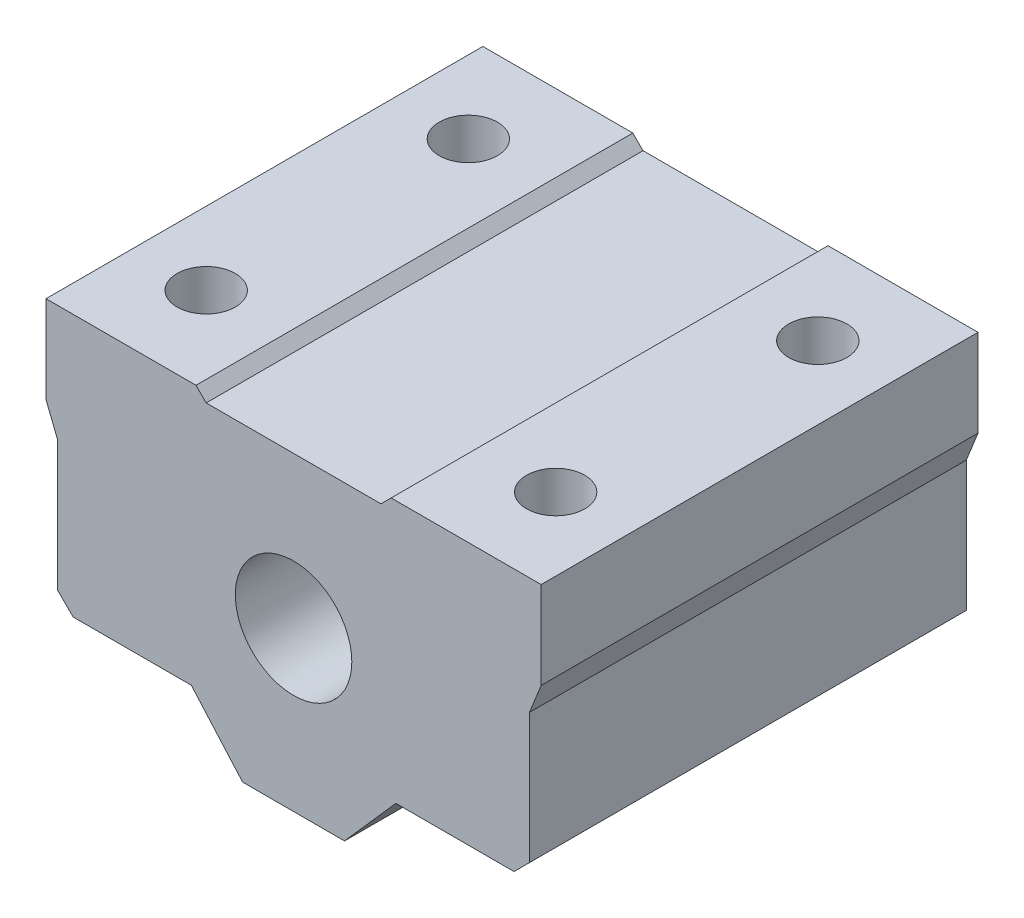
ISO-10303-21;
HEADER;
FILE_DESCRIPTION(('STEP AP214'),'2;1');
FILE_NAME('part.step','',(''),(''),'','','');
FILE_SCHEMA(('AUTOMOTIVE_DESIGN { 1 0 10303 214 1 1 1 1 }'));
ENDSEC;
DATA;
#1=APPLICATION_CONTEXT('core data for automotive mechanical design processes');
#2=APPLICATION_PROTOCOL_DEFINITION('international standard','automotive_design',2000,#1);
#3=PRODUCT_CONTEXT('',#1,'mechanical');
#4=PRODUCT('Part','Part','',(#3));
#5=PRODUCT_RELATED_PRODUCT_CATEGORY('part','',(#4));
#6=PRODUCT_DEFINITION_FORMATION('','',#4);
#7=PRODUCT_DEFINITION_CONTEXT('part definition',#1,'design');
#8=PRODUCT_DEFINITION('design','',#6,#7);
#9=PRODUCT_DEFINITION_SHAPE('','',#8);
#10=(LENGTH_UNIT() NAMED_UNIT(*) SI_UNIT(.MILLI.,.METRE.));
#11=(NAMED_UNIT(*) PLANE_ANGLE_UNIT() SI_UNIT($,.RADIAN.));
#12=(NAMED_UNIT(*) SI_UNIT($,.STERADIAN.) SOLID_ANGLE_UNIT());
#13=UNCERTAINTY_MEASURE_WITH_UNIT(LENGTH_MEASURE(1.E-05),#10,'distance_accuracy_value','');
#14=(GEOMETRIC_REPRESENTATION_CONTEXT(3) GLOBAL_UNCERTAINTY_ASSIGNED_CONTEXT((#13)) GLOBAL_UNIT_ASSIGNED_CONTEXT((#10,
#11,#12)) REPRESENTATION_CONTEXT('',''));
#15=CARTESIAN_POINT('',(0.,0.,0.));
#16=DIRECTION('',(0.,0.,1.));
#17=DIRECTION('',(1.,0.,0.));
#18=AXIS2_PLACEMENT_3D('',#15,#16,#17);
#19=CARTESIAN_POINT('',(0.,11.0960796301964,30.));
#20=DIRECTION('',(0.,1.,0.));
#21=DIRECTION('',(-1.,0.,0.));
#22=AXIS2_PLACEMENT_3D('',#19,#20,#21);
#23=PLANE('',#22);
#24=CARTESIAN_POINT('',(12.,11.0960796301964,24.));
#25=DIRECTION('',(0.,-1.,0.));
#26=DIRECTION('',(-1.,0.,0.));
#27=AXIS2_PLACEMENT_3D('',#24,#25,#26);
#28=CIRCLE('',#27,2.);
#29=CARTESIAN_POINT('',(10.,11.0960796301964,24.));
#30=VERTEX_POINT('',#29);
#31=EDGE_CURVE('E356',#30,#30,#28,.T.);
#32=ORIENTED_EDGE('',*,*,#31,.T.);
#33=EDGE_LOOP('',(#32));
#34=FACE_BOUND('',#33,.T.);
#35=CARTESIAN_POINT('',(12.,11.0960796301964,6.));
#36=DIRECTION('',(0.,-1.,0.));
#37=DIRECTION('',(-1.,0.,0.));
#38=AXIS2_PLACEMENT_3D('',#35,#36,#37);
#39=CIRCLE('',#38,2.);
#40=CARTESIAN_POINT('',(10.,11.0960796301964,6.));
#41=VERTEX_POINT('',#40);
#42=EDGE_CURVE('E359',#41,#41,#39,.T.);
#43=ORIENTED_EDGE('',*,*,#42,.T.);
#44=EDGE_LOOP('',(#43));
#45=FACE_BOUND('',#44,.T.);
#46=DIRECTION('',(1.,0.,0.));
#47=VECTOR('',#46,1.);
#48=CARTESIAN_POINT('',(0.,11.0960796301964,0.));
#49=LINE('',#48,#47);
#50=CARTESIAN_POINT('',(6.7,11.0960796301964,0.));
#51=VERTEX_POINT('',#50);
#52=CARTESIAN_POINT('',(17.,11.0960796301964,0.));
#53=VERTEX_POINT('',#52);
#54=EDGE_CURVE('E192',#51,#53,#49,.T.);
#55=ORIENTED_EDGE('',*,*,#54,.F.);
#56=DIRECTION('',(0.,0.,-1.));
#57=VECTOR('',#56,1.);
#58=CARTESIAN_POINT('',(6.7,11.0960796301964,30.));
#59=LINE('',#58,#57);
#60=CARTESIAN_POINT('',(6.7,11.0960796301964,30.));
#61=VERTEX_POINT('',#60);
#62=EDGE_CURVE('E11',#61,#51,#59,.T.);
#63=ORIENTED_EDGE('',*,*,#62,.F.);
#64=DIRECTION('',(1.,0.,0.));
#65=VECTOR('',#64,1.);
#66=CARTESIAN_POINT('',(0.,11.0960796301964,30.));
#67=LINE('',#66,#65);
#68=CARTESIAN_POINT('',(17.,11.0960796301964,30.));
#69=VERTEX_POINT('',#68);
#70=EDGE_CURVE('E240',#61,#69,#67,.T.);
#71=ORIENTED_EDGE('',*,*,#70,.T.);
#72=DIRECTION('',(0.,0.,-1.));
#73=VECTOR('',#72,1.);
#74=CARTESIAN_POINT('',(17.,11.0960796301964,30.));
#75=LINE('',#74,#73);
#76=EDGE_CURVE('E51',#69,#53,#75,.T.);
#77=ORIENTED_EDGE('',*,*,#76,.T.);
#78=EDGE_LOOP('',(#55,#63,#71,#77));
#79=FACE_BOUND('',#78,.T.);
#80=ADVANCED_FACE('F35',(#34,#45,#79),#23,.T.);
#81=CARTESIAN_POINT('',(-2.19803981509819,2.19803981509817,30.));
#82=DIRECTION('',(-0.70710678118655,0.707106781186545,0.));
#83=DIRECTION('',(-0.707106781186545,-0.70710678118655,0.));
#84=AXIS2_PLACEMENT_3D('',#81,#82,#83);
#85=PLANE('',#84);
#86=DIRECTION('',(0.707106781186545,0.70710678118655,0.));
#87=VECTOR('',#86,1.);
#88=CARTESIAN_POINT('',(-2.19803981509819,2.19803981509817,0.));
#89=LINE('',#88,#87);
#90=CARTESIAN_POINT('',(6.,10.3960796301964,0.));
#91=VERTEX_POINT('',#90);
#92=EDGE_CURVE('E194',#91,#51,#89,.T.);
#93=ORIENTED_EDGE('',*,*,#92,.F.);
#94=DIRECTION('',(0.,0.,-1.));
#95=VECTOR('',#94,1.);
#96=CARTESIAN_POINT('',(6.,10.3960796301964,30.));
#97=LINE('',#96,#95);
#98=CARTESIAN_POINT('',(6.,10.3960796301964,30.));
#99=VERTEX_POINT('',#98);
#100=EDGE_CURVE('E43',#99,#91,#97,.T.);
#101=ORIENTED_EDGE('',*,*,#100,.F.);
#102=DIRECTION('',(0.707106781186545,0.70710678118655,0.));
#103=VECTOR('',#102,1.);
#104=CARTESIAN_POINT('',(-2.19803981509819,2.19803981509817,30.));
#105=LINE('',#104,#103);
#106=EDGE_CURVE('E296',#99,#61,#105,.T.);
#107=ORIENTED_EDGE('',*,*,#106,.T.);
#108=ORIENTED_EDGE('',*,*,#62,.T.);
#109=EDGE_LOOP('',(#93,#101,#107,#108));
#110=FACE_BOUND('',#109,.T.);
#111=ADVANCED_FACE('F282',(#110),#85,.T.);
#112=CARTESIAN_POINT('',(0.,10.3960796301964,30.));
#113=DIRECTION('',(0.,1.,0.));
#114=DIRECTION('',(0.,0.,1.));
#115=AXIS2_PLACEMENT_3D('',#112,#113,#114);
#116=PLANE('',#115);
#117=DIRECTION('',(1.,0.,0.));
#118=VECTOR('',#117,1.);
#119=CARTESIAN_POINT('',(0.,10.3960796301964,0.));
#120=LINE('',#119,#118);
#121=CARTESIAN_POINT('',(-6.,10.3960796301964,0.));
#122=VERTEX_POINT('',#121);
#123=EDGE_CURVE('E198',#122,#91,#120,.T.);
#124=ORIENTED_EDGE('',*,*,#123,.F.);
#125=DIRECTION('',(0.,0.,-1.));
#126=VECTOR('',#125,1.);
#127=CARTESIAN_POINT('',(-6.,10.3960796301964,30.));
#128=LINE('',#127,#126);
#129=CARTESIAN_POINT('',(-6.,10.3960796301964,30.));
#130=VERTEX_POINT('',#129);
#131=EDGE_CURVE('E271',#130,#122,#128,.T.);
#132=ORIENTED_EDGE('',*,*,#131,.F.);
#133=DIRECTION('',(1.,0.,0.));
#134=VECTOR('',#133,1.);
#135=CARTESIAN_POINT('',(0.,10.3960796301964,30.));
#136=LINE('',#135,#134);
#137=EDGE_CURVE('E278',#130,#99,#136,.T.);
#138=ORIENTED_EDGE('',*,*,#137,.T.);
#139=ORIENTED_EDGE('',*,*,#100,.T.);
#140=EDGE_LOOP('',(#124,#132,#138,#139));
#141=FACE_BOUND('',#140,.T.);
#142=ADVANCED_FACE('F276',(#141),#116,.T.);
#143=CARTESIAN_POINT('',(2.1980398150982,2.19803981509819,30.));
#144=DIRECTION('',(0.707106781186549,0.707106781186546,0.));
#145=DIRECTION('',(-0.707106781186546,0.707106781186549,0.));
#146=AXIS2_PLACEMENT_3D('',#143,#144,#145);
#147=PLANE('',#146);
#148=DIRECTION('',(0.707106781186546,-0.707106781186549,0.));
#149=VECTOR('',#148,1.);
#150=CARTESIAN_POINT('',(2.1980398150982,2.19803981509819,0.));
#151=LINE('',#150,#149);
#152=CARTESIAN_POINT('',(-6.7,11.0960796301964,0.));
#153=VERTEX_POINT('',#152);
#154=EDGE_CURVE('E201',#153,#122,#151,.T.);
#155=ORIENTED_EDGE('',*,*,#154,.F.);
#156=DIRECTION('',(0.,0.,-1.));
#157=VECTOR('',#156,1.);
#158=CARTESIAN_POINT('',(-6.7,11.0960796301964,30.));
#159=LINE('',#158,#157);
#160=CARTESIAN_POINT('',(-6.7,11.0960796301964,30.));
#161=VERTEX_POINT('',#160);
#162=EDGE_CURVE('E269',#161,#153,#159,.T.);
#163=ORIENTED_EDGE('',*,*,#162,.F.);
#164=DIRECTION('',(0.707106781186546,-0.707106781186549,0.));
#165=VECTOR('',#164,1.);
#166=CARTESIAN_POINT('',(2.1980398150982,2.19803981509819,30.));
#167=LINE('',#166,#165);
#168=EDGE_CURVE('E293',#161,#130,#167,.T.);
#169=ORIENTED_EDGE('',*,*,#168,.T.);
#170=ORIENTED_EDGE('',*,*,#131,.T.);
#171=EDGE_LOOP('',(#155,#163,#169,#170));
#172=FACE_BOUND('',#171,.T.);
#173=ADVANCED_FACE('F290',(#172),#147,.T.);
#174=CARTESIAN_POINT('',(0.,11.0960796301964,30.));
#175=DIRECTION('',(0.,1.,0.));
#176=DIRECTION('',(0.,0.,1.));
#177=AXIS2_PLACEMENT_3D('',#174,#175,#176);
#178=PLANE('',#177);
#179=CARTESIAN_POINT('',(-12.,11.0960796301964,6.));
#180=DIRECTION('',(0.,-1.,0.));
#181=DIRECTION('',(1.,0.,0.));
#182=AXIS2_PLACEMENT_3D('',#179,#180,#181);
#183=CIRCLE('',#182,2.);
#184=CARTESIAN_POINT('',(-10.,11.0960796301964,6.));
#185=VERTEX_POINT('',#184);
#186=EDGE_CURVE('E365',#185,#185,#183,.T.);
#187=ORIENTED_EDGE('',*,*,#186,.T.);
#188=EDGE_LOOP('',(#187));
#189=FACE_BOUND('',#188,.T.);
#190=CARTESIAN_POINT('',(-12.,11.0960796301964,24.));
#191=DIRECTION('',(0.,-1.,0.));
#192=DIRECTION('',(1.,0.,0.));
#193=AXIS2_PLACEMENT_3D('',#190,#191,#192);
#194=CIRCLE('',#193,2.);
#195=CARTESIAN_POINT('',(-10.,11.0960796301964,24.));
#196=VERTEX_POINT('',#195);
#197=EDGE_CURVE('E195',#196,#196,#194,.T.);
#198=ORIENTED_EDGE('',*,*,#197,.T.);
#199=EDGE_LOOP('',(#198));
#200=FACE_BOUND('',#199,.T.);
#201=DIRECTION('',(1.,0.,0.));
#202=VECTOR('',#201,1.);
#203=CARTESIAN_POINT('',(0.,11.0960796301964,0.));
#204=LINE('',#203,#202);
#205=CARTESIAN_POINT('',(-17.,11.0960796301964,0.));
#206=VERTEX_POINT('',#205);
#207=EDGE_CURVE('E204',#206,#153,#204,.T.);
#208=ORIENTED_EDGE('',*,*,#207,.F.);
#209=DIRECTION('',(0.,0.,-1.));
#210=VECTOR('',#209,1.);
#211=CARTESIAN_POINT('',(-17.,11.0960796301964,30.));
#212=LINE('',#211,#210);
#213=CARTESIAN_POINT('',(-17.,11.0960796301964,30.));
#214=VERTEX_POINT('',#213);
#215=EDGE_CURVE('E267',#214,#206,#212,.T.);
#216=ORIENTED_EDGE('',*,*,#215,.F.);
#217=DIRECTION('',(1.,0.,0.));
#218=VECTOR('',#217,1.);
#219=CARTESIAN_POINT('',(0.,11.0960796301964,30.));
#220=LINE('',#219,#218);
#221=EDGE_CURVE('E298',#214,#161,#220,.T.);
#222=ORIENTED_EDGE('',*,*,#221,.T.);
#223=ORIENTED_EDGE('',*,*,#162,.T.);
#224=EDGE_LOOP('',(#208,#216,#222,#223));
#225=FACE_BOUND('',#224,.T.);
#226=ADVANCED_FACE('F431',(#189,#200,#225),#178,.T.);
#227=CARTESIAN_POINT('',(-17.,0.,30.));
#228=DIRECTION('',(1.,0.,0.));
#229=DIRECTION('',(0.,0.,-1.));
#230=AXIS2_PLACEMENT_3D('',#227,#228,#229);
#231=PLANE('',#230);
#232=DIRECTION('',(0.,-1.,0.));
#233=VECTOR('',#232,1.);
#234=CARTESIAN_POINT('',(-17.,0.,0.));
#235=LINE('',#234,#233);
#236=CARTESIAN_POINT('',(-17.,5.09607963019642,0.));
#237=VERTEX_POINT('',#236);
#238=EDGE_CURVE('E207',#206,#237,#235,.T.);
#239=ORIENTED_EDGE('',*,*,#238,.T.);
#240=DIRECTION('',(0.,0.,-1.));
#241=VECTOR('',#240,1.);
#242=CARTESIAN_POINT('',(-17.,5.09607963019642,30.));
#243=LINE('',#242,#241);
#244=CARTESIAN_POINT('',(-17.,5.09607963019642,30.));
#245=VERTEX_POINT('',#244);
#246=EDGE_CURVE('E264',#245,#237,#243,.T.);
#247=ORIENTED_EDGE('',*,*,#246,.F.);
#248=DIRECTION('',(0.,-1.,0.));
#249=VECTOR('',#248,1.);
#250=CARTESIAN_POINT('',(-17.,0.,30.));
#251=LINE('',#250,#249);
#252=EDGE_CURVE('E304',#214,#245,#251,.T.);
#253=ORIENTED_EDGE('',*,*,#252,.F.);
#254=ORIENTED_EDGE('',*,*,#215,.T.);
#255=EDGE_LOOP('',(#239,#247,#253,#254));
#256=FACE_BOUND('',#255,.T.);
#257=ADVANCED_FACE('F427',(#256),#231,.F.);
#258=CARTESIAN_POINT('',(-12.8979035757943,-5.15916143031773,30.));
#259=DIRECTION('',(0.92847669088526,0.371390676354103,0.));
#260=DIRECTION('',(-0.371390676354103,0.92847669088526,0.));
#261=AXIS2_PLACEMENT_3D('',#258,#259,#260);
#262=PLANE('',#261);
#263=DIRECTION('',(0.371390676354103,-0.92847669088526,0.));
#264=VECTOR('',#263,1.);
#265=CARTESIAN_POINT('',(-12.8979035757943,-5.15916143031773,0.));
#266=LINE('',#265,#264);
#267=CARTESIAN_POINT('',(-16.2,3.09607963019642,0.));
#268=VERTEX_POINT('',#267);
#269=EDGE_CURVE('E209',#237,#268,#266,.T.);
#270=ORIENTED_EDGE('',*,*,#269,.T.);
#271=DIRECTION('',(0.,0.,-1.));
#272=VECTOR('',#271,1.);
#273=CARTESIAN_POINT('',(-16.2,3.09607963019642,30.));
#274=LINE('',#273,#272);
#275=CARTESIAN_POINT('',(-16.2,3.09607963019642,30.));
#276=VERTEX_POINT('',#275);
#277=EDGE_CURVE('E261',#276,#268,#274,.T.);
#278=ORIENTED_EDGE('',*,*,#277,.F.);
#279=DIRECTION('',(0.371390676354103,-0.92847669088526,0.));
#280=VECTOR('',#279,1.);
#281=CARTESIAN_POINT('',(-12.8979035757943,-5.15916143031773,30.));
#282=LINE('',#281,#280);
#283=EDGE_CURVE('E306',#245,#276,#282,.T.);
#284=ORIENTED_EDGE('',*,*,#283,.F.);
#285=ORIENTED_EDGE('',*,*,#246,.T.);
#286=EDGE_LOOP('',(#270,#278,#284,#285));
#287=FACE_BOUND('',#286,.T.);
#288=ADVANCED_FACE('F423',(#287),#262,.F.);
#289=CARTESIAN_POINT('',(-16.2,0.,30.));
#290=DIRECTION('',(1.,0.,0.));
#291=DIRECTION('',(0.,0.,-1.));
#292=AXIS2_PLACEMENT_3D('',#289,#290,#291);
#293=PLANE('',#292);
#294=DIRECTION('',(0.,-1.,0.));
#295=VECTOR('',#294,1.);
#296=CARTESIAN_POINT('',(-16.2,0.,0.));
#297=LINE('',#296,#295);
#298=CARTESIAN_POINT('',(-16.2,-5.84326019802376,0.));
#299=VERTEX_POINT('',#298);
#300=EDGE_CURVE('E211',#268,#299,#297,.T.);
#301=ORIENTED_EDGE('',*,*,#300,.T.);
#302=DIRECTION('',(0.,0.,-1.));
#303=VECTOR('',#302,1.);
#304=CARTESIAN_POINT('',(-16.2,-5.84326019802376,30.));
#305=LINE('',#304,#303);
#306=CARTESIAN_POINT('',(-16.2,-5.84326019802376,30.));
#307=VERTEX_POINT('',#306);
#308=EDGE_CURVE('E258',#307,#299,#305,.T.);
#309=ORIENTED_EDGE('',*,*,#308,.F.);
#310=DIRECTION('',(0.,-1.,0.));
#311=VECTOR('',#310,1.);
#312=CARTESIAN_POINT('',(-16.2,0.,30.));
#313=LINE('',#312,#311);
#314=EDGE_CURVE('E308',#276,#307,#313,.T.);
#315=ORIENTED_EDGE('',*,*,#314,.F.);
#316=ORIENTED_EDGE('',*,*,#277,.T.);
#317=EDGE_LOOP('',(#301,#309,#315,#316));
#318=FACE_BOUND('',#317,.T.);
#319=ADVANCED_FACE('F419',(#318),#293,.F.);
#320=CARTESIAN_POINT('',(-11.0216300990119,-11.0216300990119,30.));
#321=DIRECTION('',(0.707106781186548,0.707106781186547,0.));
#322=DIRECTION('',(-0.707106781186547,0.707106781186548,0.));
#323=AXIS2_PLACEMENT_3D('',#320,#321,#322);
#324=PLANE('',#323);
#325=DIRECTION('',(0.707106781186547,-0.707106781186548,0.));
#326=VECTOR('',#325,1.);
#327=CARTESIAN_POINT('',(-11.0216300990119,-11.0216300990119,0.));
#328=LINE('',#327,#326);
#329=CARTESIAN_POINT('',(-15.1393398282202,-6.90392036980358,0.));
#330=VERTEX_POINT('',#329);
#331=EDGE_CURVE('E213',#299,#330,#328,.T.);
#332=ORIENTED_EDGE('',*,*,#331,.T.);
#333=DIRECTION('',(0.,0.,-1.));
#334=VECTOR('',#333,1.);
#335=CARTESIAN_POINT('',(-15.1393398282202,-6.90392036980358,30.));
#336=LINE('',#335,#334);
#337=CARTESIAN_POINT('',(-15.1393398282202,-6.90392036980358,30.));
#338=VERTEX_POINT('',#337);
#339=EDGE_CURVE('E256',#338,#330,#336,.T.);
#340=ORIENTED_EDGE('',*,*,#339,.F.);
#341=DIRECTION('',(0.707106781186547,-0.707106781186548,0.));
#342=VECTOR('',#341,1.);
#343=CARTESIAN_POINT('',(-11.0216300990119,-11.0216300990119,30.));
#344=LINE('',#343,#342);
#345=EDGE_CURVE('E310',#307,#338,#344,.T.);
#346=ORIENTED_EDGE('',*,*,#345,.F.);
#347=ORIENTED_EDGE('',*,*,#308,.T.);
#348=EDGE_LOOP('',(#332,#340,#346,#347));
#349=FACE_BOUND('',#348,.T.);
#350=ADVANCED_FACE('F387',(#349),#324,.F.);
#351=CARTESIAN_POINT('',(0.,-6.90392036980358,30.));
#352=DIRECTION('',(0.,-1.,0.));
#353=DIRECTION('',(1.,0.,0.));
#354=AXIS2_PLACEMENT_3D('',#351,#352,#353);
#355=PLANE('',#354);
#356=CARTESIAN_POINT('',(-12.,-6.90392036980358,6.));
#357=DIRECTION('',(0.,-1.,0.));
#358=DIRECTION('',(1.,0.,0.));
#359=AXIS2_PLACEMENT_3D('',#356,#357,#358);
#360=CIRCLE('',#359,2.);
#361=CARTESIAN_POINT('',(-10.,-6.90392036980358,6.));
#362=VERTEX_POINT('',#361);
#363=EDGE_CURVE('E361',#362,#362,#360,.T.);
#364=ORIENTED_EDGE('',*,*,#363,.F.);
#365=EDGE_LOOP('',(#364));
#366=FACE_BOUND('',#365,.T.);
#367=CARTESIAN_POINT('',(-12.,-6.90392036980358,24.));
#368=DIRECTION('',(0.,-1.,0.));
#369=DIRECTION('',(1.,0.,0.));
#370=AXIS2_PLACEMENT_3D('',#367,#368,#369);
#371=CIRCLE('',#370,2.);
#372=CARTESIAN_POINT('',(-10.,-6.90392036980358,24.));
#373=VERTEX_POINT('',#372);
#374=EDGE_CURVE('E374',#373,#373,#371,.T.);
#375=ORIENTED_EDGE('',*,*,#374,.F.);
#376=EDGE_LOOP('',(#375));
#377=FACE_BOUND('',#376,.T.);
#378=DIRECTION('',(-1.,0.,0.));
#379=VECTOR('',#378,1.);
#380=CARTESIAN_POINT('',(0.,-6.90392036980358,0.));
#381=LINE('',#380,#379);
#382=CARTESIAN_POINT('',(-7.0246075966208,-6.90392036980358,0.));
#383=VERTEX_POINT('',#382);
#384=EDGE_CURVE('E216',#383,#330,#381,.T.);
#385=ORIENTED_EDGE('',*,*,#384,.F.);
#386=DIRECTION('',(0.,0.,-1.));
#387=VECTOR('',#386,1.);
#388=CARTESIAN_POINT('',(-7.0246075966208,-6.90392036980358,30.));
#389=LINE('',#388,#387);
#390=CARTESIAN_POINT('',(-7.0246075966208,-6.90392036980358,30.));
#391=VERTEX_POINT('',#390);
#392=EDGE_CURVE('E254',#391,#383,#389,.T.);
#393=ORIENTED_EDGE('',*,*,#392,.F.);
#394=DIRECTION('',(-1.,0.,0.));
#395=VECTOR('',#394,1.);
#396=CARTESIAN_POINT('',(0.,-6.90392036980358,30.));
#397=LINE('',#396,#395);
#398=EDGE_CURVE('E312',#391,#338,#397,.T.);
#399=ORIENTED_EDGE('',*,*,#398,.T.);
#400=ORIENTED_EDGE('',*,*,#339,.T.);
#401=EDGE_LOOP('',(#385,#393,#399,#400));
#402=FACE_BOUND('',#401,.T.);
#403=ADVANCED_FACE('F383',(#366,#377,#402),#355,.T.);
#404=CARTESIAN_POINT('',(-7.37885532247622,-6.50189238099138,30.));
#405=DIRECTION('',(-0.750284739622902,-0.661114823225885,0.));
#406=DIRECTION('',(0.661114823225885,-0.750284739622902,0.));
#407=AXIS2_PLACEMENT_3D('',#404,#405,#406);
#408=PLANE('',#407);
#409=DIRECTION('',(-0.661114823225885,0.750284739622902,0.));
#410=VECTOR('',#409,1.);
#411=CARTESIAN_POINT('',(-7.37885532247622,-6.50189238099138,0.));
#412=LINE('',#411,#410);
#413=CARTESIAN_POINT('',(-3.5,-10.9039203698036,0.));
#414=VERTEX_POINT('',#413);
#415=EDGE_CURVE('E219',#414,#383,#412,.T.);
#416=ORIENTED_EDGE('',*,*,#415,.F.);
#417=DIRECTION('',(0.,0.,-1.));
#418=VECTOR('',#417,1.);
#419=CARTESIAN_POINT('',(-3.5,-10.9039203698036,30.));
#420=LINE('',#419,#418);
#421=CARTESIAN_POINT('',(-3.5,-10.9039203698036,30.));
#422=VERTEX_POINT('',#421);
#423=EDGE_CURVE('E252',#422,#414,#420,.T.);
#424=ORIENTED_EDGE('',*,*,#423,.F.);
#425=DIRECTION('',(-0.661114823225885,0.750284739622902,0.));
#426=VECTOR('',#425,1.);
#427=CARTESIAN_POINT('',(-7.37885532247622,-6.50189238099138,30.));
#428=LINE('',#427,#426);
#429=EDGE_CURVE('E315',#422,#391,#428,.T.);
#430=ORIENTED_EDGE('',*,*,#429,.T.);
#431=ORIENTED_EDGE('',*,*,#392,.T.);
#432=EDGE_LOOP('',(#416,#424,#430,#431));
#433=FACE_BOUND('',#432,.T.);
#434=ADVANCED_FACE('F386',(#433),#408,.T.);
#435=CARTESIAN_POINT('',(0.,-10.9039203698036,30.));
#436=DIRECTION('',(0.,-1.,0.));
#437=DIRECTION('',(1.,0.,0.));
#438=AXIS2_PLACEMENT_3D('',#435,#436,#437);
#439=PLANE('',#438);
#440=DIRECTION('',(-1.,0.,0.));
#441=VECTOR('',#440,1.);
#442=CARTESIAN_POINT('',(0.,-10.9039203698036,0.));
#443=LINE('',#442,#441);
#444=CARTESIAN_POINT('',(3.5,-10.9039203698036,0.));
#445=VERTEX_POINT('',#444);
#446=EDGE_CURVE('E222',#445,#414,#443,.T.);
#447=ORIENTED_EDGE('',*,*,#446,.F.);
#448=DIRECTION('',(0.,0.,-1.));
#449=VECTOR('',#448,1.);
#450=CARTESIAN_POINT('',(3.5,-10.9039203698036,30.));
#451=LINE('',#450,#449);
#452=CARTESIAN_POINT('',(3.5,-10.9039203698036,30.));
#453=VERTEX_POINT('',#452);
#454=EDGE_CURVE('E250',#453,#445,#451,.T.);
#455=ORIENTED_EDGE('',*,*,#454,.F.);
#456=DIRECTION('',(-1.,0.,0.));
#457=VECTOR('',#456,1.);
#458=CARTESIAN_POINT('',(0.,-10.9039203698036,30.));
#459=LINE('',#458,#457);
#460=EDGE_CURVE('E318',#453,#422,#459,.T.);
#461=ORIENTED_EDGE('',*,*,#460,.T.);
#462=ORIENTED_EDGE('',*,*,#423,.T.);
#463=EDGE_LOOP('',(#447,#455,#461,#462));
#464=FACE_BOUND('',#463,.T.);
#465=ADVANCED_FACE('F400',(#464),#439,.T.);
#466=CARTESIAN_POINT('',(7.37885532247623,-6.50189238099133,30.));
#467=DIRECTION('',(-0.750284739622905,0.661114823225882,0.));
#468=DIRECTION('',(-0.661114823225882,-0.750284739622905,0.));
#469=AXIS2_PLACEMENT_3D('',#466,#467,#468);
#470=PLANE('',#469);
#471=DIRECTION('',(0.661114823225882,0.750284739622905,0.));
#472=VECTOR('',#471,1.);
#473=CARTESIAN_POINT('',(7.37885532247623,-6.50189238099133,0.));
#474=LINE('',#473,#472);
#475=CARTESIAN_POINT('',(7.02460759662078,-6.90392036980357,0.));
#476=VERTEX_POINT('',#475);
#477=EDGE_CURVE('E225',#445,#476,#474,.T.);
#478=ORIENTED_EDGE('',*,*,#477,.T.);
#479=DIRECTION('',(0.,0.,-1.));
#480=VECTOR('',#479,1.);
#481=CARTESIAN_POINT('',(7.02460759662078,-6.90392036980357,30.));
#482=LINE('',#481,#480);
#483=CARTESIAN_POINT('',(7.02460759662078,-6.90392036980357,30.));
#484=VERTEX_POINT('',#483);
#485=EDGE_CURVE('E247',#484,#476,#482,.T.);
#486=ORIENTED_EDGE('',*,*,#485,.F.);
#487=DIRECTION('',(0.661114823225882,0.750284739622905,0.));
#488=VECTOR('',#487,1.);
#489=CARTESIAN_POINT('',(7.37885532247623,-6.50189238099133,30.));
#490=LINE('',#489,#488);
#491=EDGE_CURVE('E321',#453,#484,#490,.T.);
#492=ORIENTED_EDGE('',*,*,#491,.F.);
#493=ORIENTED_EDGE('',*,*,#454,.T.);
#494=EDGE_LOOP('',(#478,#486,#492,#493));
#495=FACE_BOUND('',#494,.T.);
#496=ADVANCED_FACE('F402',(#495),#470,.F.);
#497=CARTESIAN_POINT('',(0.,-6.90392036980356,30.));
#498=DIRECTION('',(0.,1.,0.));
#499=DIRECTION('',(-1.,0.,0.));
#500=AXIS2_PLACEMENT_3D('',#497,#498,#499);
#501=PLANE('',#500);
#502=CARTESIAN_POINT('',(12.,-6.90392036980357,24.));
#503=DIRECTION('',(0.,-1.,0.));
#504=DIRECTION('',(-1.,0.,0.));
#505=AXIS2_PLACEMENT_3D('',#502,#503,#504);
#506=CIRCLE('',#505,2.);
#507=CARTESIAN_POINT('',(10.,-6.90392036980357,24.));
#508=VERTEX_POINT('',#507);
#509=EDGE_CURVE('E370',#508,#508,#506,.T.);
#510=ORIENTED_EDGE('',*,*,#509,.F.);
#511=EDGE_LOOP('',(#510));
#512=FACE_BOUND('',#511,.T.);
#513=CARTESIAN_POINT('',(12.,-6.90392036980357,6.));
#514=DIRECTION('',(0.,-1.,0.));
#515=DIRECTION('',(-1.,0.,0.));
#516=AXIS2_PLACEMENT_3D('',#513,#514,#515);
#517=CIRCLE('',#516,2.);
#518=CARTESIAN_POINT('',(10.,-6.90392036980357,6.));
#519=VERTEX_POINT('',#518);
#520=EDGE_CURVE('E362',#519,#519,#517,.T.);
#521=ORIENTED_EDGE('',*,*,#520,.F.);
#522=EDGE_LOOP('',(#521));
#523=FACE_BOUND('',#522,.T.);
#524=DIRECTION('',(1.,0.,0.));
#525=VECTOR('',#524,1.);
#526=CARTESIAN_POINT('',(0.,-6.90392036980356,0.));
#527=LINE('',#526,#525);
#528=CARTESIAN_POINT('',(15.1393398282202,-6.90392036980357,0.));
#529=VERTEX_POINT('',#528);
#530=EDGE_CURVE('E227',#476,#529,#527,.T.);
#531=ORIENTED_EDGE('',*,*,#530,.T.);
#532=DIRECTION('',(0.,0.,-1.));
#533=VECTOR('',#532,1.);
#534=CARTESIAN_POINT('',(15.1393398282202,-6.90392036980357,30.));
#535=LINE('',#534,#533);
#536=CARTESIAN_POINT('',(15.1393398282202,-6.90392036980357,30.));
#537=VERTEX_POINT('',#536);
#538=EDGE_CURVE('E244',#537,#529,#535,.T.);
#539=ORIENTED_EDGE('',*,*,#538,.F.);
#540=DIRECTION('',(1.,0.,0.));
#541=VECTOR('',#540,1.);
#542=CARTESIAN_POINT('',(0.,-6.90392036980356,30.));
#543=LINE('',#542,#541);
#544=EDGE_CURVE('E323',#484,#537,#543,.T.);
#545=ORIENTED_EDGE('',*,*,#544,.F.);
#546=ORIENTED_EDGE('',*,*,#485,.T.);
#547=EDGE_LOOP('',(#531,#539,#545,#546));
#548=FACE_BOUND('',#547,.T.);
#549=ADVANCED_FACE('F330',(#512,#523,#548),#501,.F.);
#550=CARTESIAN_POINT('',(11.0216300990119,-11.0216300990119,30.));
#551=DIRECTION('',(-0.707106781186547,0.707106781186548,0.));
#552=DIRECTION('',(-0.707106781186548,-0.707106781186547,0.));
#553=AXIS2_PLACEMENT_3D('',#550,#551,#552);
#554=PLANE('',#553);
#555=DIRECTION('',(0.707106781186548,0.707106781186547,0.));
#556=VECTOR('',#555,1.);
#557=CARTESIAN_POINT('',(11.0216300990119,-11.0216300990119,0.));
#558=LINE('',#557,#556);
#559=CARTESIAN_POINT('',(16.2,-5.84326019802375,0.));
#560=VERTEX_POINT('',#559);
#561=EDGE_CURVE('E229',#529,#560,#558,.T.);
#562=ORIENTED_EDGE('',*,*,#561,.T.);
#563=DIRECTION('',(0.,0.,-1.));
#564=VECTOR('',#563,1.);
#565=CARTESIAN_POINT('',(16.2,-5.84326019802375,30.));
#566=LINE('',#565,#564);
#567=CARTESIAN_POINT('',(16.2,-5.84326019802375,30.));
#568=VERTEX_POINT('',#567);
#569=EDGE_CURVE('E181',#568,#560,#566,.T.);
#570=ORIENTED_EDGE('',*,*,#569,.F.);
#571=DIRECTION('',(0.707106781186548,0.707106781186547,0.));
#572=VECTOR('',#571,1.);
#573=CARTESIAN_POINT('',(11.0216300990119,-11.0216300990119,30.));
#574=LINE('',#573,#572);
#575=EDGE_CURVE('E169',#537,#568,#574,.T.);
#576=ORIENTED_EDGE('',*,*,#575,.F.);
#577=ORIENTED_EDGE('',*,*,#538,.T.);
#578=EDGE_LOOP('',(#562,#570,#576,#577));
#579=FACE_BOUND('',#578,.T.);
#580=ADVANCED_FACE('F334',(#579),#554,.F.);
#581=CARTESIAN_POINT('',(16.2,0.,30.));
#582=DIRECTION('',(-1.,0.,0.));
#583=DIRECTION('',(0.,-1.,0.));
#584=AXIS2_PLACEMENT_3D('',#581,#582,#583);
#585=PLANE('',#584);
#586=DIRECTION('',(0.,1.,0.));
#587=VECTOR('',#586,1.);
#588=CARTESIAN_POINT('',(16.2,0.,0.));
#589=LINE('',#588,#587);
#590=CARTESIAN_POINT('',(16.2,3.09607963019643,0.));
#591=VERTEX_POINT('',#590);
#592=EDGE_CURVE('E178',#560,#591,#589,.T.);
#593=ORIENTED_EDGE('',*,*,#592,.T.);
#594=DIRECTION('',(0.,0.,-1.));
#595=VECTOR('',#594,1.);
#596=CARTESIAN_POINT('',(16.2,3.09607963019643,30.));
#597=LINE('',#596,#595);
#598=CARTESIAN_POINT('',(16.2,3.09607963019643,30.));
#599=VERTEX_POINT('',#598);
#600=EDGE_CURVE('E175',#599,#591,#597,.T.);
#601=ORIENTED_EDGE('',*,*,#600,.F.);
#602=DIRECTION('',(0.,1.,0.));
#603=VECTOR('',#602,1.);
#604=CARTESIAN_POINT('',(16.2,0.,30.));
#605=LINE('',#604,#603);
#606=EDGE_CURVE('E161',#568,#599,#605,.T.);
#607=ORIENTED_EDGE('',*,*,#606,.F.);
#608=ORIENTED_EDGE('',*,*,#569,.T.);
#609=EDGE_LOOP('',(#593,#601,#607,#608));
#610=FACE_BOUND('',#609,.T.);
#611=ADVANCED_FACE('F176',(#610),#585,.F.);
#612=CARTESIAN_POINT('',(12.8979035757942,-5.15916143031781,30.));
#613=DIRECTION('',(0.928476690885256,-0.371390676354111,0.));
#614=DIRECTION('',(0.371390676354111,0.928476690885256,0.));
#615=AXIS2_PLACEMENT_3D('',#612,#613,#614);
#616=PLANE('',#615);
#617=DIRECTION('',(-0.371390676354111,-0.928476690885256,0.));
#618=VECTOR('',#617,1.);
#619=CARTESIAN_POINT('',(12.8979035757942,-5.15916143031781,0.));
#620=LINE('',#619,#618);
#621=CARTESIAN_POINT('',(17.,5.09607963019642,0.));
#622=VERTEX_POINT('',#621);
#623=EDGE_CURVE('E232',#622,#591,#620,.T.);
#624=ORIENTED_EDGE('',*,*,#623,.F.);
#625=DIRECTION('',(0.,0.,-1.));
#626=VECTOR('',#625,1.);
#627=CARTESIAN_POINT('',(17.,5.09607963019642,30.));
#628=LINE('',#627,#626);
#629=CARTESIAN_POINT('',(17.,5.09607963019642,30.));
#630=VERTEX_POINT('',#629);
#631=EDGE_CURVE('E106',#630,#622,#628,.T.);
#632=ORIENTED_EDGE('',*,*,#631,.F.);
#633=DIRECTION('',(-0.371390676354111,-0.928476690885256,0.));
#634=VECTOR('',#633,1.);
#635=CARTESIAN_POINT('',(12.8979035757942,-5.15916143031781,30.));
#636=LINE('',#635,#634);
#637=EDGE_CURVE('E167',#630,#599,#636,.T.);
#638=ORIENTED_EDGE('',*,*,#637,.T.);
#639=ORIENTED_EDGE('',*,*,#600,.T.);
#640=EDGE_LOOP('',(#624,#632,#638,#639));
#641=FACE_BOUND('',#640,.T.);
#642=ADVANCED_FACE('F183',(#641),#616,.T.);
#643=CARTESIAN_POINT('',(17.,0.,30.));
#644=DIRECTION('',(1.,0.,0.));
#645=DIRECTION('',(0.,0.,-1.));
#646=AXIS2_PLACEMENT_3D('',#643,#644,#645);
#647=PLANE('',#646);
#648=DIRECTION('',(0.,-1.,0.));
#649=VECTOR('',#648,1.);
#650=CARTESIAN_POINT('',(17.,0.,0.));
#651=LINE('',#650,#649);
#652=EDGE_CURVE('E234',#53,#622,#651,.T.);
#653=ORIENTED_EDGE('',*,*,#652,.F.);
#654=ORIENTED_EDGE('',*,*,#76,.F.);
#655=DIRECTION('',(0.,-1.,0.));
#656=VECTOR('',#655,1.);
#657=CARTESIAN_POINT('',(17.,0.,30.));
#658=LINE('',#657,#656);
#659=EDGE_CURVE('E184',#69,#630,#658,.T.);
#660=ORIENTED_EDGE('',*,*,#659,.T.);
#661=ORIENTED_EDGE('',*,*,#631,.T.);
#662=EDGE_LOOP('',(#653,#654,#660,#661));
#663=FACE_BOUND('',#662,.T.);
#664=ADVANCED_FACE('F335',(#663),#647,.T.);
#665=CARTESIAN_POINT('',(0.,0.,30.));
#666=DIRECTION('',(0.,0.,-1.));
#667=DIRECTION('',(-1.,0.,0.));
#668=AXIS2_PLACEMENT_3D('',#665,#666,#667);
#669=CYLINDRICAL_SURFACE('',#668,4.);
#670=CARTESIAN_POINT('',(0.,0.,30.));
#671=DIRECTION('',(0.,0.,1.));
#672=DIRECTION('',(1.,0.,0.));
#673=AXIS2_PLACEMENT_3D('',#670,#671,#672);
#674=CIRCLE('',#673,4.);
#675=CARTESIAN_POINT('',(4.,0.,30.));
#676=VERTEX_POINT('',#675);
#677=EDGE_CURVE('E186',#676,#676,#674,.T.);
#678=ORIENTED_EDGE('',*,*,#677,.T.);
#679=EDGE_LOOP('',(#678));
#680=FACE_BOUND('',#679,.T.);
#681=CARTESIAN_POINT('',(0.,0.,0.));
#682=DIRECTION('',(0.,0.,1.));
#683=DIRECTION('',(1.,0.,0.));
#684=AXIS2_PLACEMENT_3D('',#681,#682,#683);
#685=CIRCLE('',#684,4.);
#686=CARTESIAN_POINT('',(4.,0.,0.));
#687=VERTEX_POINT('',#686);
#688=EDGE_CURVE('E237',#687,#687,#685,.T.);
#689=ORIENTED_EDGE('',*,*,#688,.F.);
#690=EDGE_LOOP('',(#689));
#691=FACE_BOUND('',#690,.T.);
#692=ADVANCED_FACE('F337',(#680,#691),#669,.F.);
#693=CARTESIAN_POINT('',(0.,0.,30.));
#694=DIRECTION('',(0.,0.,1.));
#695=DIRECTION('',(1.,0.,0.));
#696=AXIS2_PLACEMENT_3D('',#693,#694,#695);
#697=PLANE('',#696);
#698=ORIENTED_EDGE('',*,*,#70,.F.);
#699=ORIENTED_EDGE('',*,*,#106,.F.);
#700=ORIENTED_EDGE('',*,*,#137,.F.);
#701=ORIENTED_EDGE('',*,*,#168,.F.);
#702=ORIENTED_EDGE('',*,*,#221,.F.);
#703=ORIENTED_EDGE('',*,*,#252,.T.);
#704=ORIENTED_EDGE('',*,*,#283,.T.);
#705=ORIENTED_EDGE('',*,*,#314,.T.);
#706=ORIENTED_EDGE('',*,*,#345,.T.);
#707=ORIENTED_EDGE('',*,*,#398,.F.);
#708=ORIENTED_EDGE('',*,*,#429,.F.);
#709=ORIENTED_EDGE('',*,*,#460,.F.);
#710=ORIENTED_EDGE('',*,*,#491,.T.);
#711=ORIENTED_EDGE('',*,*,#544,.T.);
#712=ORIENTED_EDGE('',*,*,#575,.T.);
#713=ORIENTED_EDGE('',*,*,#606,.T.);
#714=ORIENTED_EDGE('',*,*,#637,.F.);
#715=ORIENTED_EDGE('',*,*,#659,.F.);
#716=EDGE_LOOP('',(#698,#699,#700,#701,#702,#703,#704,#705,#706,#707,#708,#709,#710,#711,#712,
#713,#714,#715));
#717=FACE_BOUND('',#716,.T.);
#718=ORIENTED_EDGE('',*,*,#677,.F.);
#719=EDGE_LOOP('',(#718));
#720=FACE_BOUND('',#719,.T.);
#721=ADVANCED_FACE('F163',(#717,#720),#697,.T.);
#722=CARTESIAN_POINT('',(0.,0.,0.));
#723=DIRECTION('',(0.,0.,1.));
#724=DIRECTION('',(1.,0.,0.));
#725=AXIS2_PLACEMENT_3D('',#722,#723,#724);
#726=PLANE('',#725);
#727=ORIENTED_EDGE('',*,*,#54,.T.);
#728=ORIENTED_EDGE('',*,*,#652,.T.);
#729=ORIENTED_EDGE('',*,*,#623,.T.);
#730=ORIENTED_EDGE('',*,*,#592,.F.);
#731=ORIENTED_EDGE('',*,*,#561,.F.);
#732=ORIENTED_EDGE('',*,*,#530,.F.);
#733=ORIENTED_EDGE('',*,*,#477,.F.);
#734=ORIENTED_EDGE('',*,*,#446,.T.);
#735=ORIENTED_EDGE('',*,*,#415,.T.);
#736=ORIENTED_EDGE('',*,*,#384,.T.);
#737=ORIENTED_EDGE('',*,*,#331,.F.);
#738=ORIENTED_EDGE('',*,*,#300,.F.);
#739=ORIENTED_EDGE('',*,*,#269,.F.);
#740=ORIENTED_EDGE('',*,*,#238,.F.);
#741=ORIENTED_EDGE('',*,*,#207,.T.);
#742=ORIENTED_EDGE('',*,*,#154,.T.);
#743=ORIENTED_EDGE('',*,*,#123,.T.);
#744=ORIENTED_EDGE('',*,*,#92,.T.);
#745=EDGE_LOOP('',(#727,#728,#729,#730,#731,#732,#733,#734,#735,#736,#737,#738,#739,#740,#741,
#742,#743,#744));
#746=FACE_BOUND('',#745,.T.);
#747=ORIENTED_EDGE('',*,*,#688,.T.);
#748=EDGE_LOOP('',(#747));
#749=FACE_BOUND('',#748,.T.);
#750=ADVANCED_FACE('F284',(#746,#749),#726,.F.);
#751=CARTESIAN_POINT('',(-12.,11.0960796301964,24.));
#752=DIRECTION('',(0.,-1.,0.));
#753=DIRECTION('',(1.,0.,0.));
#754=AXIS2_PLACEMENT_3D('',#751,#752,#753);
#755=CYLINDRICAL_SURFACE('',#754,2.);
#756=ORIENTED_EDGE('',*,*,#197,.F.);
#757=EDGE_LOOP('',(#756));
#758=FACE_BOUND('',#757,.T.);
#759=ORIENTED_EDGE('',*,*,#374,.T.);
#760=EDGE_LOOP('',(#759));
#761=FACE_BOUND('',#760,.T.);
#762=ADVANCED_FACE('F381',(#758,#761),#755,.F.);
#763=CARTESIAN_POINT('',(-12.,11.0960796301964,6.));
#764=DIRECTION('',(0.,-1.,0.));
#765=DIRECTION('',(1.,0.,0.));
#766=AXIS2_PLACEMENT_3D('',#763,#764,#765);
#767=CYLINDRICAL_SURFACE('',#766,2.);
#768=ORIENTED_EDGE('',*,*,#186,.F.);
#769=EDGE_LOOP('',(#768));
#770=FACE_BOUND('',#769,.T.);
#771=ORIENTED_EDGE('',*,*,#363,.T.);
#772=EDGE_LOOP('',(#771));
#773=FACE_BOUND('',#772,.T.);
#774=ADVANCED_FACE('F545',(#770,#773),#767,.F.);
#775=CARTESIAN_POINT('',(12.,11.0960796301964,6.));
#776=DIRECTION('',(0.,-1.,0.));
#777=DIRECTION('',(1.,0.,0.));
#778=AXIS2_PLACEMENT_3D('',#775,#776,#777);
#779=CYLINDRICAL_SURFACE('',#778,2.);
#780=ORIENTED_EDGE('',*,*,#42,.F.);
#781=EDGE_LOOP('',(#780));
#782=FACE_BOUND('',#781,.T.);
#783=ORIENTED_EDGE('',*,*,#520,.T.);
#784=EDGE_LOOP('',(#783));
#785=FACE_BOUND('',#784,.T.);
#786=ADVANCED_FACE('F552',(#782,#785),#779,.F.);
#787=CARTESIAN_POINT('',(12.,11.0960796301964,24.));
#788=DIRECTION('',(0.,-1.,0.));
#789=DIRECTION('',(1.,0.,0.));
#790=AXIS2_PLACEMENT_3D('',#787,#788,#789);
#791=CYLINDRICAL_SURFACE('',#790,2.);
#792=ORIENTED_EDGE('',*,*,#31,.F.);
#793=EDGE_LOOP('',(#792));
#794=FACE_BOUND('',#793,.T.);
#795=ORIENTED_EDGE('',*,*,#509,.T.);
#796=EDGE_LOOP('',(#795));
#797=FACE_BOUND('',#796,.T.);
#798=ADVANCED_FACE('F560',(#794,#797),#791,.F.);
#799=CLOSED_SHELL('',(#80,#111,#142,#173,#226,#257,#288,#319,#350,#403,#434,#465,#496,#549,#580,
#611,#642,#664,#692,#721,#750,#762,#774,#786,#798));
#800=MANIFOLD_SOLID_BREP('B2',#799);
#801=ADVANCED_BREP_SHAPE_REPRESENTATION('',(#18,#800),#14);
#802=SHAPE_DEFINITION_REPRESENTATION(#9,#801);
ENDSEC;
END-ISO-10303-21;
